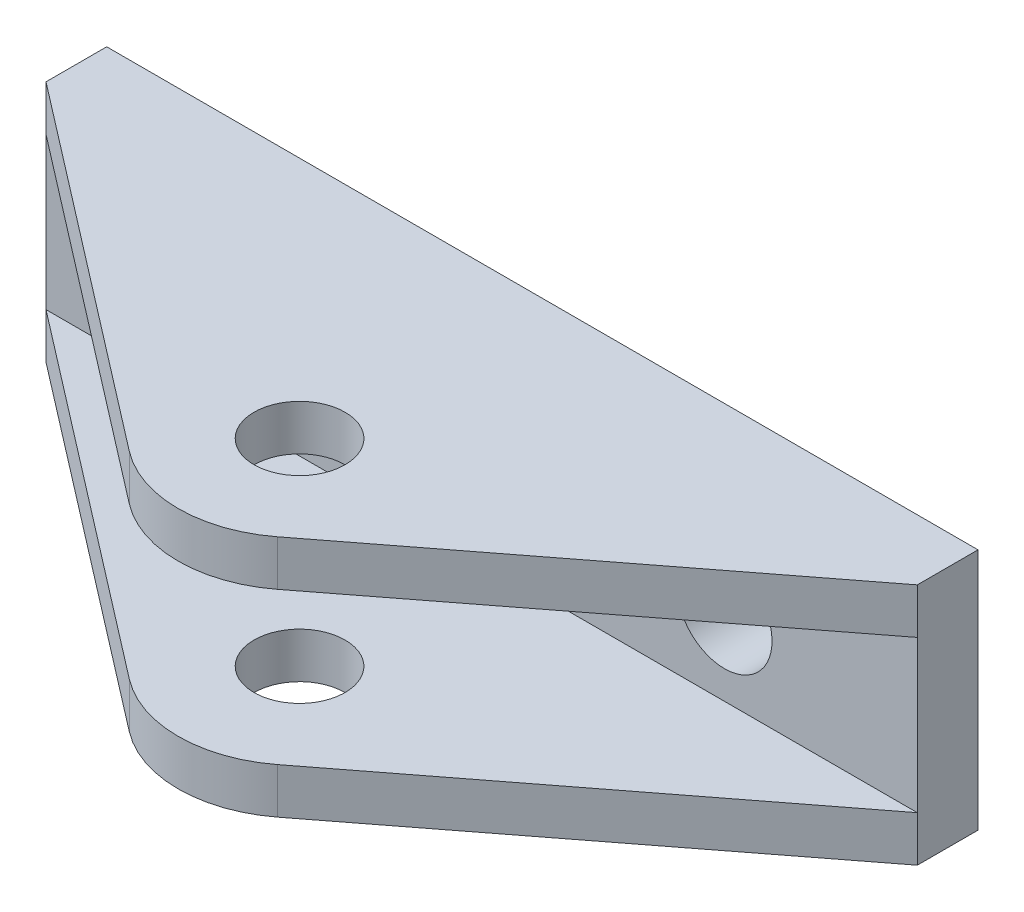
ISO-10303-21;
HEADER;
FILE_DESCRIPTION(('STEP AP214'),'2;1');
FILE_NAME('part.step','',(''),(''),'','','');
FILE_SCHEMA(('AUTOMOTIVE_DESIGN { 1 0 10303 214 1 1 1 1 }'));
ENDSEC;
DATA;
#1=APPLICATION_CONTEXT('core data for automotive mechanical design processes');
#2=APPLICATION_PROTOCOL_DEFINITION('international standard','automotive_design',2000,#1);
#3=PRODUCT_CONTEXT('',#1,'mechanical');
#4=PRODUCT('Part','Part','',(#3));
#5=PRODUCT_RELATED_PRODUCT_CATEGORY('part','',(#4));
#6=PRODUCT_DEFINITION_FORMATION('','',#4);
#7=PRODUCT_DEFINITION_CONTEXT('part definition',#1,'design');
#8=PRODUCT_DEFINITION('design','',#6,#7);
#9=PRODUCT_DEFINITION_SHAPE('','',#8);
#10=(LENGTH_UNIT() NAMED_UNIT(*) SI_UNIT(.MILLI.,.METRE.));
#11=(NAMED_UNIT(*) PLANE_ANGLE_UNIT() SI_UNIT($,.RADIAN.));
#12=(NAMED_UNIT(*) SI_UNIT($,.STERADIAN.) SOLID_ANGLE_UNIT());
#13=UNCERTAINTY_MEASURE_WITH_UNIT(LENGTH_MEASURE(1.E-05),#10,'distance_accuracy_value','');
#14=(GEOMETRIC_REPRESENTATION_CONTEXT(3) GLOBAL_UNCERTAINTY_ASSIGNED_CONTEXT((#13)) GLOBAL_UNIT_ASSIGNED_CONTEXT((#10,
#11,#12)) REPRESENTATION_CONTEXT('',''));
#15=CARTESIAN_POINT('',(0.,0.,0.));
#16=DIRECTION('',(0.,0.,1.));
#17=DIRECTION('',(1.,0.,0.));
#18=AXIS2_PLACEMENT_3D('',#15,#16,#17);
#19=CARTESIAN_POINT('',(266.873839605101,-7.14375,3.17500000000003));
#20=DIRECTION('',(0.,-1.,0.));
#21=DIRECTION('',(0.,0.,-1.));
#22=AXIS2_PLACEMENT_3D('',#19,#20,#21);
#23=PLANE('',#22);
#24=DIRECTION('',(-0.792464627555552,0.,-0.609917874859592));
#25=VECTOR('',#24,1.);
#26=CARTESIAN_POINT('',(289.660883812759,-7.14375,20.7129759476929));
#27=LINE('',#26,#25);
#28=CARTESIAN_POINT('',(266.873839605101,-7.14375,3.17500000000003));
#29=VERTEX_POINT('',#28);
#30=CARTESIAN_POINT('',(285.787905307401,-7.14375,17.7321503849778));
#31=VERTEX_POINT('',#30);
#32=EDGE_CURVE('E100',#29,#31,#27,.F.);
#33=ORIENTED_EDGE('',*,*,#32,.T.);
#34=CARTESIAN_POINT('',(289.660883812759,-7.14375000000001,12.7000000000001));
#35=DIRECTION('',(0.,1.,0.));
#36=DIRECTION('',(0.,0.,1.));
#37=AXIS2_PLACEMENT_3D('',#34,#35,#36);
#38=CIRCLE('',#37,6.35);
#39=CARTESIAN_POINT('',(293.533862318117,-7.14375000000001,17.7321503849778));
#40=VERTEX_POINT('',#39);
#41=EDGE_CURVE('E90',#40,#31,#38,.F.);
#42=ORIENTED_EDGE('',*,*,#41,.F.);
#43=DIRECTION('',(-0.792464627555552,0.,0.609917874859592));
#44=VECTOR('',#43,1.);
#45=CARTESIAN_POINT('',(312.447928020418,-7.14375000000001,3.17500000000003));
#46=LINE('',#45,#44);
#47=CARTESIAN_POINT('',(312.447928020418,-7.14375,3.17500000000003));
#48=VERTEX_POINT('',#47);
#49=EDGE_CURVE('E98',#40,#48,#46,.F.);
#50=ORIENTED_EDGE('',*,*,#49,.T.);
#51=DIRECTION('',(1.,0.,0.));
#52=VECTOR('',#51,1.);
#53=CARTESIAN_POINT('',(266.873839605101,-7.14375,3.17500000000003));
#54=LINE('',#53,#52);
#55=EDGE_CURVE('E109',#48,#29,#54,.F.);
#56=ORIENTED_EDGE('',*,*,#55,.T.);
#57=EDGE_LOOP('',(#33,#42,#50,#56));
#58=FACE_BOUND('',#57,.T.);
#59=CARTESIAN_POINT('',(289.660883812759,-7.14375000000001,12.7000000000001));
#60=DIRECTION('',(0.,-1.,0.));
#61=DIRECTION('',(0.,0.,-1.));
#62=AXIS2_PLACEMENT_3D('',#59,#60,#61);
#63=CIRCLE('',#62,2.38125);
#64=CARTESIAN_POINT('',(289.660883812759,-7.14375000000001,10.3187500000001));
#65=VERTEX_POINT('',#64);
#66=EDGE_CURVE('E19',#65,#65,#63,.T.);
#67=ORIENTED_EDGE('',*,*,#66,.T.);
#68=EDGE_LOOP('',(#67));
#69=FACE_BOUND('',#68,.T.);
#70=ADVANCED_FACE('F16',(#58,#69),#23,.F.);
#71=CARTESIAN_POINT('',(266.873839605101,0.793750000000001,3.17500000000003));
#72=DIRECTION('',(0.,1.,0.));
#73=DIRECTION('',(0.,0.,1.));
#74=AXIS2_PLACEMENT_3D('',#71,#72,#73);
#75=PLANE('',#74);
#76=CARTESIAN_POINT('',(289.660883812759,0.793749999999996,12.7000000000001));
#77=DIRECTION('',(0.,1.,0.));
#78=DIRECTION('',(0.,0.,1.));
#79=AXIS2_PLACEMENT_3D('',#76,#77,#78);
#80=CIRCLE('',#79,6.35);
#81=CARTESIAN_POINT('',(285.787905307401,0.793749999999996,17.7321503849778));
#82=VERTEX_POINT('',#81);
#83=CARTESIAN_POINT('',(293.533862318117,0.793749999999996,17.7321503849778));
#84=VERTEX_POINT('',#83);
#85=EDGE_CURVE('E166',#82,#84,#80,.T.);
#86=ORIENTED_EDGE('',*,*,#85,.F.);
#87=DIRECTION('',(-0.792464627555552,0.,-0.609917874859592));
#88=VECTOR('',#87,1.);
#89=CARTESIAN_POINT('',(289.660883812759,0.793749999999996,20.7129759476929));
#90=LINE('',#89,#88);
#91=CARTESIAN_POINT('',(266.873839605101,0.79375,3.17500000000003));
#92=VERTEX_POINT('',#91);
#93=EDGE_CURVE('E130',#82,#92,#90,.T.);
#94=ORIENTED_EDGE('',*,*,#93,.T.);
#95=DIRECTION('',(1.,0.,0.));
#96=VECTOR('',#95,1.);
#97=CARTESIAN_POINT('',(266.873839605101,0.793750000000001,3.17500000000003));
#98=LINE('',#97,#96);
#99=CARTESIAN_POINT('',(312.447928020418,0.793750000000001,3.17500000000003));
#100=VERTEX_POINT('',#99);
#101=EDGE_CURVE('E177',#92,#100,#98,.T.);
#102=ORIENTED_EDGE('',*,*,#101,.T.);
#103=DIRECTION('',(-0.792464627555552,0.,0.609917874859592));
#104=VECTOR('',#103,1.);
#105=CARTESIAN_POINT('',(312.447928020418,0.793750000000001,3.17500000000003));
#106=LINE('',#105,#104);
#107=EDGE_CURVE('E173',#100,#84,#106,.T.);
#108=ORIENTED_EDGE('',*,*,#107,.T.);
#109=EDGE_LOOP('',(#86,#94,#102,#108));
#110=FACE_BOUND('',#109,.T.);
#111=CARTESIAN_POINT('',(289.660883812759,0.793749999999998,12.7000000000001));
#112=DIRECTION('',(0.,-1.,0.));
#113=DIRECTION('',(0.,0.,-1.));
#114=AXIS2_PLACEMENT_3D('',#111,#112,#113);
#115=CIRCLE('',#114,2.38125);
#116=CARTESIAN_POINT('',(289.660883812759,0.793749999999998,10.3187500000001));
#117=VERTEX_POINT('',#116);
#118=EDGE_CURVE('E133',#117,#117,#115,.F.);
#119=ORIENTED_EDGE('',*,*,#118,.T.);
#120=EDGE_LOOP('',(#119));
#121=FACE_BOUND('',#120,.T.);
#122=ADVANCED_FACE('F277',(#110,#121),#75,.F.);
#123=CARTESIAN_POINT('',(289.660883812759,-9.525,12.7000000000001));
#124=DIRECTION('',(0.,-1.,0.));
#125=DIRECTION('',(0.,0.,-1.));
#126=AXIS2_PLACEMENT_3D('',#123,#124,#125);
#127=CYLINDRICAL_SURFACE('',#126,2.38125);
#128=CARTESIAN_POINT('',(289.660883812759,-9.525,12.7000000000001));
#129=DIRECTION('',(0.,-1.,0.));
#130=DIRECTION('',(0.,0.,-1.));
#131=AXIS2_PLACEMENT_3D('',#128,#129,#130);
#132=CIRCLE('',#131,2.38125);
#133=CARTESIAN_POINT('',(289.660883812759,-9.525,10.3187500000001));
#134=VERTEX_POINT('',#133);
#135=EDGE_CURVE('E155',#134,#134,#132,.F.);
#136=ORIENTED_EDGE('',*,*,#135,.F.);
#137=EDGE_LOOP('',(#136));
#138=FACE_BOUND('',#137,.T.);
#139=ORIENTED_EDGE('',*,*,#66,.F.);
#140=EDGE_LOOP('',(#139));
#141=FACE_BOUND('',#140,.T.);
#142=ADVANCED_FACE('F417',(#138,#141),#127,.F.);
#143=CARTESIAN_POINT('',(289.660883812759,-9.525,12.7000000000001));
#144=DIRECTION('',(0.,1.,0.));
#145=DIRECTION('',(0.,0.,1.));
#146=AXIS2_PLACEMENT_3D('',#143,#144,#145);
#147=CYLINDRICAL_SURFACE('',#146,6.35);
#148=ORIENTED_EDGE('',*,*,#41,.T.);
#149=DIRECTION('',(0.,1.,0.));
#150=VECTOR('',#149,1.);
#151=CARTESIAN_POINT('',(285.787905307401,-9.525,17.7321503849778));
#152=LINE('',#151,#150);
#153=CARTESIAN_POINT('',(285.787905307401,-9.525,17.7321503849778));
#154=VERTEX_POINT('',#153);
#155=EDGE_CURVE('E113',#31,#154,#152,.F.);
#156=ORIENTED_EDGE('',*,*,#155,.T.);
#157=CARTESIAN_POINT('',(289.660883812759,-9.525,12.7000000000001));
#158=DIRECTION('',(0.,1.,0.));
#159=DIRECTION('',(0.,0.,1.));
#160=AXIS2_PLACEMENT_3D('',#157,#158,#159);
#161=CIRCLE('',#160,6.35);
#162=CARTESIAN_POINT('',(293.533862318117,-9.525,17.7321503849778));
#163=VERTEX_POINT('',#162);
#164=EDGE_CURVE('E112',#163,#154,#161,.F.);
#165=ORIENTED_EDGE('',*,*,#164,.F.);
#166=DIRECTION('',(0.,1.,0.));
#167=VECTOR('',#166,1.);
#168=CARTESIAN_POINT('',(293.533862318117,-9.525,17.7321503849778));
#169=LINE('',#168,#167);
#170=EDGE_CURVE('E105',#163,#40,#169,.T.);
#171=ORIENTED_EDGE('',*,*,#170,.T.);
#172=EDGE_LOOP('',(#148,#156,#165,#171));
#173=FACE_BOUND('',#172,.T.);
#174=ADVANCED_FACE('F111',(#173),#147,.T.);
#175=CARTESIAN_POINT('',(289.660883812759,-9.525,20.7129759476929));
#176=DIRECTION('',(0.609917874859592,0.,-0.792464627555552));
#177=DIRECTION('',(-0.792464627555552,0.,-0.609917874859592));
#178=AXIS2_PLACEMENT_3D('',#175,#176,#177);
#179=PLANE('',#178);
#180=ORIENTED_EDGE('',*,*,#32,.F.);
#181=DIRECTION('',(0.,1.,0.));
#182=VECTOR('',#181,1.);
#183=CARTESIAN_POINT('',(266.873839605101,-9.525,3.17500000000003));
#184=LINE('',#183,#182);
#185=CARTESIAN_POINT('',(266.873839605101,-9.525,3.17500000000003));
#186=VERTEX_POINT('',#185);
#187=EDGE_CURVE('E126',#29,#186,#184,.F.);
#188=ORIENTED_EDGE('',*,*,#187,.T.);
#189=DIRECTION('',(-0.792464627555552,0.,-0.609917874859592));
#190=VECTOR('',#189,1.);
#191=CARTESIAN_POINT('',(285.787905307401,-9.525,17.7321503849778));
#192=LINE('',#191,#190);
#193=EDGE_CURVE('E153',#154,#186,#192,.T.);
#194=ORIENTED_EDGE('',*,*,#193,.F.);
#195=ORIENTED_EDGE('',*,*,#155,.F.);
#196=EDGE_LOOP('',(#180,#188,#194,#195));
#197=FACE_BOUND('',#196,.T.);
#198=ADVANCED_FACE('F270',(#197),#179,.F.);
#199=CARTESIAN_POINT('',(312.447928020418,-9.525,3.17500000000003));
#200=DIRECTION('',(-0.609917874859592,0.,-0.792464627555552));
#201=DIRECTION('',(-0.792464627555552,0.,0.609917874859592));
#202=AXIS2_PLACEMENT_3D('',#199,#200,#201);
#203=PLANE('',#202);
#204=ORIENTED_EDGE('',*,*,#49,.F.);
#205=ORIENTED_EDGE('',*,*,#170,.F.);
#206=DIRECTION('',(-0.792464627555552,0.,0.609917874859591));
#207=VECTOR('',#206,1.);
#208=CARTESIAN_POINT('',(312.447928020418,-9.525,3.17500000000003));
#209=LINE('',#208,#207);
#210=CARTESIAN_POINT('',(312.447928020418,-9.525,3.17500000000003));
#211=VERTEX_POINT('',#210);
#212=EDGE_CURVE('E154',#211,#163,#209,.T.);
#213=ORIENTED_EDGE('',*,*,#212,.F.);
#214=DIRECTION('',(0.,1.,0.));
#215=VECTOR('',#214,1.);
#216=CARTESIAN_POINT('',(312.447928020418,-9.525,3.17500000000003));
#217=LINE('',#216,#215);
#218=EDGE_CURVE('E108',#211,#48,#217,.T.);
#219=ORIENTED_EDGE('',*,*,#218,.T.);
#220=EDGE_LOOP('',(#204,#205,#213,#219));
#221=FACE_BOUND('',#220,.T.);
#222=ADVANCED_FACE('F104',(#221),#203,.F.);
#223=CARTESIAN_POINT('',(266.873839605101,0.793750000000001,3.17500000000003));
#224=DIRECTION('',(0.,0.,-1.));
#225=DIRECTION('',(0.,1.,0.));
#226=AXIS2_PLACEMENT_3D('',#223,#224,#225);
#227=PLANE('',#226);
#228=ORIENTED_EDGE('',*,*,#101,.F.);
#229=DIRECTION('',(0.,1.,0.));
#230=VECTOR('',#229,1.);
#231=CARTESIAN_POINT('',(266.873839605101,-9.525,3.17500000000003));
#232=LINE('',#231,#230);
#233=EDGE_CURVE('E123',#92,#29,#232,.F.);
#234=ORIENTED_EDGE('',*,*,#233,.T.);
#235=ORIENTED_EDGE('',*,*,#55,.F.);
#236=DIRECTION('',(0.,1.,0.));
#237=VECTOR('',#236,1.);
#238=CARTESIAN_POINT('',(312.447928020418,-9.525,3.17500000000003));
#239=LINE('',#238,#237);
#240=EDGE_CURVE('E189',#48,#100,#239,.T.);
#241=ORIENTED_EDGE('',*,*,#240,.T.);
#242=EDGE_LOOP('',(#228,#234,#235,#241));
#243=FACE_BOUND('',#242,.T.);
#244=CARTESIAN_POINT('',(276.960883812759,-3.175,3.17500000000003));
#245=DIRECTION('',(0.,0.,1.));
#246=DIRECTION('',(0.,-1.,0.));
#247=AXIS2_PLACEMENT_3D('',#244,#245,#246);
#248=CIRCLE('',#247,2.4892);
#249=CARTESIAN_POINT('',(276.960883812759,-5.6642,3.17500000000003));
#250=VERTEX_POINT('',#249);
#251=EDGE_CURVE('E158',#250,#250,#248,.F.);
#252=ORIENTED_EDGE('',*,*,#251,.T.);
#253=EDGE_LOOP('',(#252));
#254=FACE_BOUND('',#253,.T.);
#255=CARTESIAN_POINT('',(302.360883812759,-3.175,3.17500000000003));
#256=DIRECTION('',(0.,0.,1.));
#257=DIRECTION('',(0.,-1.,0.));
#258=AXIS2_PLACEMENT_3D('',#255,#256,#257);
#259=CIRCLE('',#258,2.4892);
#260=CARTESIAN_POINT('',(302.360883812759,-5.6642,3.17500000000003));
#261=VERTEX_POINT('',#260);
#262=EDGE_CURVE('E161',#261,#261,#259,.F.);
#263=ORIENTED_EDGE('',*,*,#262,.T.);
#264=EDGE_LOOP('',(#263));
#265=FACE_BOUND('',#264,.T.);
#266=ADVANCED_FACE('F273',(#243,#254,#265),#227,.F.);
#267=CARTESIAN_POINT('',(312.447928020418,-9.525,3.17500000000003));
#268=DIRECTION('',(-0.609917874859592,0.,-0.792464627555552));
#269=DIRECTION('',(-0.792464627555552,0.,0.609917874859592));
#270=AXIS2_PLACEMENT_3D('',#267,#268,#269);
#271=PLANE('',#270);
#272=ORIENTED_EDGE('',*,*,#107,.F.);
#273=DIRECTION('',(0.,1.,0.));
#274=VECTOR('',#273,1.);
#275=CARTESIAN_POINT('',(312.447928020418,-9.525,3.17500000000003));
#276=LINE('',#275,#274);
#277=CARTESIAN_POINT('',(312.447928020418,3.175,3.17500000000003));
#278=VERTEX_POINT('',#277);
#279=EDGE_CURVE('E187',#100,#278,#276,.T.);
#280=ORIENTED_EDGE('',*,*,#279,.T.);
#281=DIRECTION('',(-0.792464627555552,0.,0.609917874859591));
#282=VECTOR('',#281,1.);
#283=CARTESIAN_POINT('',(312.447928020418,3.175,3.17500000000003));
#284=LINE('',#283,#282);
#285=CARTESIAN_POINT('',(293.533862318117,3.175,17.7321503849778));
#286=VERTEX_POINT('',#285);
#287=EDGE_CURVE('E151',#278,#286,#284,.T.);
#288=ORIENTED_EDGE('',*,*,#287,.T.);
#289=DIRECTION('',(0.,1.,0.));
#290=VECTOR('',#289,1.);
#291=CARTESIAN_POINT('',(293.533862318117,-9.525,17.7321503849778));
#292=LINE('',#291,#290);
#293=EDGE_CURVE('E167',#84,#286,#292,.T.);
#294=ORIENTED_EDGE('',*,*,#293,.F.);
#295=EDGE_LOOP('',(#272,#280,#288,#294));
#296=FACE_BOUND('',#295,.T.);
#297=ADVANCED_FACE('F286',(#296),#271,.F.);
#298=CARTESIAN_POINT('',(289.660883812759,-9.525,12.7000000000001));
#299=DIRECTION('',(0.,1.,0.));
#300=DIRECTION('',(0.,0.,1.));
#301=AXIS2_PLACEMENT_3D('',#298,#299,#300);
#302=CYLINDRICAL_SURFACE('',#301,6.35);
#303=CARTESIAN_POINT('',(289.660883812759,3.175,12.7000000000001));
#304=DIRECTION('',(0.,1.,0.));
#305=DIRECTION('',(0.,0.,1.));
#306=AXIS2_PLACEMENT_3D('',#303,#304,#305);
#307=CIRCLE('',#306,6.35);
#308=CARTESIAN_POINT('',(285.787905307401,3.175,17.7321503849778));
#309=VERTEX_POINT('',#308);
#310=EDGE_CURVE('E148',#286,#309,#307,.F.);
#311=ORIENTED_EDGE('',*,*,#310,.T.);
#312=DIRECTION('',(0.,1.,0.));
#313=VECTOR('',#312,1.);
#314=CARTESIAN_POINT('',(285.787905307401,-9.525,17.7321503849778));
#315=LINE('',#314,#313);
#316=EDGE_CURVE('E134',#309,#82,#315,.F.);
#317=ORIENTED_EDGE('',*,*,#316,.T.);
#318=ORIENTED_EDGE('',*,*,#85,.T.);
#319=ORIENTED_EDGE('',*,*,#293,.T.);
#320=EDGE_LOOP('',(#311,#317,#318,#319));
#321=FACE_BOUND('',#320,.T.);
#322=ADVANCED_FACE('F281',(#321),#302,.T.);
#323=CARTESIAN_POINT('',(289.660883812759,-9.525,20.7129759476929));
#324=DIRECTION('',(0.609917874859592,0.,-0.792464627555552));
#325=DIRECTION('',(-0.792464627555552,0.,-0.609917874859592));
#326=AXIS2_PLACEMENT_3D('',#323,#324,#325);
#327=PLANE('',#326);
#328=ORIENTED_EDGE('',*,*,#93,.F.);
#329=ORIENTED_EDGE('',*,*,#316,.F.);
#330=DIRECTION('',(-0.792464627555552,0.,-0.609917874859592));
#331=VECTOR('',#330,1.);
#332=CARTESIAN_POINT('',(285.787905307401,3.175,17.7321503849778));
#333=LINE('',#332,#331);
#334=CARTESIAN_POINT('',(266.873839605101,3.175,3.17500000000003));
#335=VERTEX_POINT('',#334);
#336=EDGE_CURVE('E147',#309,#335,#333,.T.);
#337=ORIENTED_EDGE('',*,*,#336,.T.);
#338=DIRECTION('',(0.,1.,0.));
#339=VECTOR('',#338,1.);
#340=CARTESIAN_POINT('',(266.873839605101,-9.525,3.17500000000003));
#341=LINE('',#340,#339);
#342=EDGE_CURVE('E127',#335,#92,#341,.F.);
#343=ORIENTED_EDGE('',*,*,#342,.T.);
#344=EDGE_LOOP('',(#328,#329,#337,#343));
#345=FACE_BOUND('',#344,.T.);
#346=ADVANCED_FACE('F280',(#345),#327,.F.);
#347=CARTESIAN_POINT('',(289.660883812759,-9.525,12.7000000000001));
#348=DIRECTION('',(0.,-1.,0.));
#349=DIRECTION('',(0.,0.,-1.));
#350=AXIS2_PLACEMENT_3D('',#347,#348,#349);
#351=CYLINDRICAL_SURFACE('',#350,2.38125);
#352=ORIENTED_EDGE('',*,*,#118,.F.);
#353=EDGE_LOOP('',(#352));
#354=FACE_BOUND('',#353,.T.);
#355=CARTESIAN_POINT('',(289.660883812759,3.175,12.7000000000001));
#356=DIRECTION('',(0.,-1.,0.));
#357=DIRECTION('',(0.,0.,-1.));
#358=AXIS2_PLACEMENT_3D('',#355,#356,#357);
#359=CIRCLE('',#358,2.38125);
#360=CARTESIAN_POINT('',(289.660883812759,3.175,10.3187500000001));
#361=VERTEX_POINT('',#360);
#362=EDGE_CURVE('E144',#361,#361,#359,.F.);
#363=ORIENTED_EDGE('',*,*,#362,.T.);
#364=EDGE_LOOP('',(#363));
#365=FACE_BOUND('',#364,.T.);
#366=ADVANCED_FACE('F317',(#354,#365),#351,.F.);
#367=CARTESIAN_POINT('',(302.360883812759,-3.175,3.17500000000003));
#368=DIRECTION('',(0.,0.,1.));
#369=DIRECTION('',(0.,-1.,0.));
#370=AXIS2_PLACEMENT_3D('',#367,#368,#369);
#371=CYLINDRICAL_SURFACE('',#370,2.4892);
#372=CARTESIAN_POINT('',(302.360883812759,-3.175,0.));
#373=DIRECTION('',(0.,0.,1.));
#374=DIRECTION('',(0.,-1.,0.));
#375=AXIS2_PLACEMENT_3D('',#372,#373,#374);
#376=CIRCLE('',#375,2.4892);
#377=CARTESIAN_POINT('',(302.360883812759,-5.6642,0.));
#378=VERTEX_POINT('',#377);
#379=EDGE_CURVE('E141',#378,#378,#376,.F.);
#380=ORIENTED_EDGE('',*,*,#379,.T.);
#381=EDGE_LOOP('',(#380));
#382=FACE_BOUND('',#381,.T.);
#383=ORIENTED_EDGE('',*,*,#262,.F.);
#384=EDGE_LOOP('',(#383));
#385=FACE_BOUND('',#384,.T.);
#386=ADVANCED_FACE('F313',(#382,#385),#371,.F.);
#387=CARTESIAN_POINT('',(276.960883812759,-3.175,3.17500000000003));
#388=DIRECTION('',(0.,0.,1.));
#389=DIRECTION('',(0.,-1.,0.));
#390=AXIS2_PLACEMENT_3D('',#387,#388,#389);
#391=CYLINDRICAL_SURFACE('',#390,2.4892);
#392=CARTESIAN_POINT('',(276.960883812759,-3.175,0.));
#393=DIRECTION('',(0.,0.,1.));
#394=DIRECTION('',(0.,-1.,0.));
#395=AXIS2_PLACEMENT_3D('',#392,#393,#394);
#396=CIRCLE('',#395,2.4892);
#397=CARTESIAN_POINT('',(276.960883812759,-5.6642,0.));
#398=VERTEX_POINT('',#397);
#399=EDGE_CURVE('E137',#398,#398,#396,.F.);
#400=ORIENTED_EDGE('',*,*,#399,.T.);
#401=EDGE_LOOP('',(#400));
#402=FACE_BOUND('',#401,.T.);
#403=ORIENTED_EDGE('',*,*,#251,.F.);
#404=EDGE_LOOP('',(#403));
#405=FACE_BOUND('',#404,.T.);
#406=ADVANCED_FACE('F310',(#402,#405),#391,.F.);
#407=CARTESIAN_POINT('',(266.873839605101,-9.525,3.17500000000003));
#408=DIRECTION('',(1.,0.,0.));
#409=DIRECTION('',(0.,0.,-1.));
#410=AXIS2_PLACEMENT_3D('',#407,#408,#409);
#411=PLANE('',#410);
#412=DIRECTION('',(0.,1.,0.));
#413=VECTOR('',#412,1.);
#414=CARTESIAN_POINT('',(266.873839605101,-9.525,0.));
#415=LINE('',#414,#413);
#416=CARTESIAN_POINT('',(266.873839605101,3.175,0.));
#417=VERTEX_POINT('',#416);
#418=CARTESIAN_POINT('',(266.873839605101,-9.525,0.));
#419=VERTEX_POINT('',#418);
#420=EDGE_CURVE('E140',#417,#419,#415,.F.);
#421=ORIENTED_EDGE('',*,*,#420,.T.);
#422=DIRECTION('',(0.,0.,-1.));
#423=VECTOR('',#422,1.);
#424=CARTESIAN_POINT('',(266.873839605101,-9.525,0.));
#425=LINE('',#424,#423);
#426=EDGE_CURVE('E228',#186,#419,#425,.T.);
#427=ORIENTED_EDGE('',*,*,#426,.F.);
#428=ORIENTED_EDGE('',*,*,#187,.F.);
#429=ORIENTED_EDGE('',*,*,#233,.F.);
#430=ORIENTED_EDGE('',*,*,#342,.F.);
#431=DIRECTION('',(0.,0.,-1.));
#432=VECTOR('',#431,1.);
#433=CARTESIAN_POINT('',(266.873839605101,3.175,0.));
#434=LINE('',#433,#432);
#435=EDGE_CURVE('E184',#335,#417,#434,.T.);
#436=ORIENTED_EDGE('',*,*,#435,.T.);
#437=EDGE_LOOP('',(#421,#427,#428,#429,#430,#436));
#438=FACE_BOUND('',#437,.T.);
#439=ADVANCED_FACE('F255',(#438),#411,.F.);
#440=CARTESIAN_POINT('',(0.,-9.525,0.));
#441=DIRECTION('',(0.,-1.,0.));
#442=DIRECTION('',(0.,0.,-1.));
#443=AXIS2_PLACEMENT_3D('',#440,#441,#442);
#444=PLANE('',#443);
#445=DIRECTION('',(1.,0.,0.));
#446=VECTOR('',#445,1.);
#447=CARTESIAN_POINT('',(266.873839605101,-9.525,0.));
#448=LINE('',#447,#446);
#449=CARTESIAN_POINT('',(312.447928020418,-9.525,0.));
#450=VERTEX_POINT('',#449);
#451=EDGE_CURVE('E196',#419,#450,#448,.T.);
#452=ORIENTED_EDGE('',*,*,#451,.T.);
#453=DIRECTION('',(0.,0.,1.));
#454=VECTOR('',#453,1.);
#455=CARTESIAN_POINT('',(312.447928020418,-9.525,0.));
#456=LINE('',#455,#454);
#457=EDGE_CURVE('E221',#450,#211,#456,.T.);
#458=ORIENTED_EDGE('',*,*,#457,.T.);
#459=ORIENTED_EDGE('',*,*,#212,.T.);
#460=ORIENTED_EDGE('',*,*,#164,.T.);
#461=ORIENTED_EDGE('',*,*,#193,.T.);
#462=ORIENTED_EDGE('',*,*,#426,.T.);
#463=EDGE_LOOP('',(#452,#458,#459,#460,#461,#462));
#464=FACE_BOUND('',#463,.T.);
#465=ORIENTED_EDGE('',*,*,#135,.T.);
#466=EDGE_LOOP('',(#465));
#467=FACE_BOUND('',#466,.T.);
#468=ADVANCED_FACE('F267',(#464,#467),#444,.T.);
#469=CARTESIAN_POINT('',(312.447928020418,-9.525,0.));
#470=DIRECTION('',(-1.,0.,0.));
#471=DIRECTION('',(0.,0.,1.));
#472=AXIS2_PLACEMENT_3D('',#469,#470,#471);
#473=PLANE('',#472);
#474=ORIENTED_EDGE('',*,*,#279,.F.);
#475=ORIENTED_EDGE('',*,*,#240,.F.);
#476=ORIENTED_EDGE('',*,*,#218,.F.);
#477=ORIENTED_EDGE('',*,*,#457,.F.);
#478=DIRECTION('',(0.,1.,0.));
#479=VECTOR('',#478,1.);
#480=CARTESIAN_POINT('',(312.447928020418,-9.525,0.));
#481=LINE('',#480,#479);
#482=CARTESIAN_POINT('',(312.447928020418,3.175,0.));
#483=VERTEX_POINT('',#482);
#484=EDGE_CURVE('E25',#450,#483,#481,.T.);
#485=ORIENTED_EDGE('',*,*,#484,.T.);
#486=DIRECTION('',(0.,0.,-1.));
#487=VECTOR('',#486,1.);
#488=CARTESIAN_POINT('',(312.447928020418,3.175,0.));
#489=LINE('',#488,#487);
#490=EDGE_CURVE('E33',#483,#278,#489,.F.);
#491=ORIENTED_EDGE('',*,*,#490,.T.);
#492=EDGE_LOOP('',(#474,#475,#476,#477,#485,#491));
#493=FACE_BOUND('',#492,.T.);
#494=ADVANCED_FACE('F266',(#493),#473,.F.);
#495=CARTESIAN_POINT('',(0.,3.175,0.));
#496=DIRECTION('',(0.,-1.,0.));
#497=DIRECTION('',(0.,0.,-1.));
#498=AXIS2_PLACEMENT_3D('',#495,#496,#497);
#499=PLANE('',#498);
#500=ORIENTED_EDGE('',*,*,#362,.F.);
#501=EDGE_LOOP('',(#500));
#502=FACE_BOUND('',#501,.T.);
#503=ORIENTED_EDGE('',*,*,#310,.F.);
#504=ORIENTED_EDGE('',*,*,#287,.F.);
#505=ORIENTED_EDGE('',*,*,#490,.F.);
#506=DIRECTION('',(1.,0.,0.));
#507=VECTOR('',#506,1.);
#508=CARTESIAN_POINT('',(266.873839605101,3.175,0.));
#509=LINE('',#508,#507);
#510=EDGE_CURVE('E11',#483,#417,#509,.F.);
#511=ORIENTED_EDGE('',*,*,#510,.T.);
#512=ORIENTED_EDGE('',*,*,#435,.F.);
#513=ORIENTED_EDGE('',*,*,#336,.F.);
#514=EDGE_LOOP('',(#503,#504,#505,#511,#512,#513));
#515=FACE_BOUND('',#514,.T.);
#516=ADVANCED_FACE('F259',(#502,#515),#499,.F.);
#517=CARTESIAN_POINT('',(266.873839605101,-9.525,0.));
#518=DIRECTION('',(0.,0.,1.));
#519=DIRECTION('',(1.,0.,0.));
#520=AXIS2_PLACEMENT_3D('',#517,#518,#519);
#521=PLANE('',#520);
#522=ORIENTED_EDGE('',*,*,#484,.F.);
#523=ORIENTED_EDGE('',*,*,#451,.F.);
#524=ORIENTED_EDGE('',*,*,#420,.F.);
#525=ORIENTED_EDGE('',*,*,#510,.F.);
#526=EDGE_LOOP('',(#522,#523,#524,#525));
#527=FACE_BOUND('',#526,.T.);
#528=ORIENTED_EDGE('',*,*,#399,.F.);
#529=EDGE_LOOP('',(#528));
#530=FACE_BOUND('',#529,.T.);
#531=ORIENTED_EDGE('',*,*,#379,.F.);
#532=EDGE_LOOP('',(#531));
#533=FACE_BOUND('',#532,.T.);
#534=ADVANCED_FACE('F262',(#527,#530,#533),#521,.F.);
#535=CLOSED_SHELL('',(#70,#122,#142,#174,#198,#222,#266,#297,#322,#346,#366,#386,#406,#439,#468,
#494,#516,#534));
#536=MANIFOLD_SOLID_BREP('B1',#535);
#537=ADVANCED_BREP_SHAPE_REPRESENTATION('',(#18,#536),#14);
#538=SHAPE_DEFINITION_REPRESENTATION(#9,#537);
ENDSEC;
END-ISO-10303-21;
